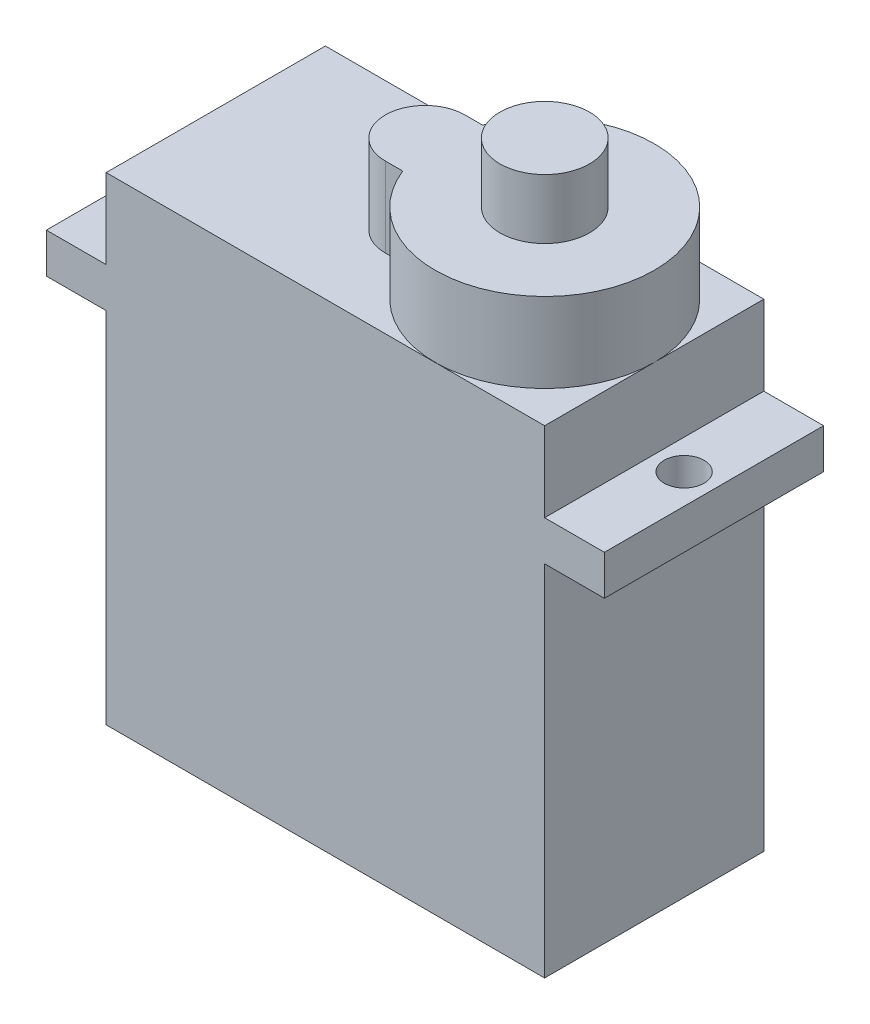
ISO-10303-21;
HEADER;
FILE_DESCRIPTION(('STEP AP214'),'2;1');
FILE_NAME('part.step','',(''),(''),'','','');
FILE_SCHEMA(('AUTOMOTIVE_DESIGN { 1 0 10303 214 1 1 1 1 }'));
ENDSEC;
DATA;
#1=APPLICATION_CONTEXT('core data for automotive mechanical design processes');
#2=APPLICATION_PROTOCOL_DEFINITION('international standard','automotive_design',2000,#1);
#3=PRODUCT_CONTEXT('',#1,'mechanical');
#4=PRODUCT('Part','Part','',(#3));
#5=PRODUCT_RELATED_PRODUCT_CATEGORY('part','',(#4));
#6=PRODUCT_DEFINITION_FORMATION('','',#4);
#7=PRODUCT_DEFINITION_CONTEXT('part definition',#1,'design');
#8=PRODUCT_DEFINITION('design','',#6,#7);
#9=PRODUCT_DEFINITION_SHAPE('','',#8);
#10=(LENGTH_UNIT() NAMED_UNIT(*) SI_UNIT(.MILLI.,.METRE.));
#11=(NAMED_UNIT(*) PLANE_ANGLE_UNIT() SI_UNIT($,.RADIAN.));
#12=(NAMED_UNIT(*) SI_UNIT($,.STERADIAN.) SOLID_ANGLE_UNIT());
#13=UNCERTAINTY_MEASURE_WITH_UNIT(LENGTH_MEASURE(1.E-05),#10,'distance_accuracy_value','');
#14=(GEOMETRIC_REPRESENTATION_CONTEXT(3) GLOBAL_UNCERTAINTY_ASSIGNED_CONTEXT((#13)) GLOBAL_UNIT_ASSIGNED_CONTEXT((#10,
#11,#12)) REPRESENTATION_CONTEXT('',''));
#15=CARTESIAN_POINT('',(0.,0.,0.));
#16=DIRECTION('',(0.,0.,1.));
#17=DIRECTION('',(1.,0.,0.));
#18=AXIS2_PLACEMENT_3D('',#15,#16,#17);
#19=CARTESIAN_POINT('',(11.,24.,5.5));
#20=DIRECTION('',(-1.,0.,0.));
#21=DIRECTION('',(0.,0.,1.));
#22=AXIS2_PLACEMENT_3D('',#19,#20,#21);
#23=PLANE('',#22);
#24=DIRECTION('',(0.,-1.,0.));
#25=VECTOR('',#24,1.);
#26=CARTESIAN_POINT('',(11.,24.,-5.5));
#27=LINE('',#26,#25);
#28=CARTESIAN_POINT('',(11.,18.,-5.5));
#29=VERTEX_POINT('',#28);
#30=CARTESIAN_POINT('',(11.,0.,-5.5));
#31=VERTEX_POINT('',#30);
#32=EDGE_CURVE('E64',#29,#31,#27,.T.);
#33=ORIENTED_EDGE('',*,*,#32,.F.);
#34=DIRECTION('',(0.,0.,1.));
#35=VECTOR('',#34,1.);
#36=CARTESIAN_POINT('',(11.,18.,-5.5));
#37=LINE('',#36,#35);
#38=CARTESIAN_POINT('',(11.,18.,5.5));
#39=VERTEX_POINT('',#38);
#40=EDGE_CURVE('E204',#29,#39,#37,.T.);
#41=ORIENTED_EDGE('',*,*,#40,.T.);
#42=DIRECTION('',(0.,-1.,0.));
#43=VECTOR('',#42,1.);
#44=CARTESIAN_POINT('',(11.,24.,5.5));
#45=LINE('',#44,#43);
#46=CARTESIAN_POINT('',(11.,0.,5.5));
#47=VERTEX_POINT('',#46);
#48=EDGE_CURVE('E180',#39,#47,#45,.T.);
#49=ORIENTED_EDGE('',*,*,#48,.T.);
#50=DIRECTION('',(0.,0.,-1.));
#51=VECTOR('',#50,1.);
#52=CARTESIAN_POINT('',(11.,0.,5.5));
#53=LINE('',#52,#51);
#54=EDGE_CURVE('E277',#47,#31,#53,.T.);
#55=ORIENTED_EDGE('',*,*,#54,.T.);
#56=EDGE_LOOP('',(#33,#41,#49,#55));
#57=FACE_BOUND('',#56,.T.);
#58=ADVANCED_FACE('F47',(#57),#23,.F.);
#59=CARTESIAN_POINT('',(-11.,24.,5.5));
#60=DIRECTION('',(1.,0.,0.));
#61=DIRECTION('',(0.,0.,-1.));
#62=AXIS2_PLACEMENT_3D('',#59,#60,#61);
#63=PLANE('',#62);
#64=DIRECTION('',(0.,0.,1.));
#65=VECTOR('',#64,1.);
#66=CARTESIAN_POINT('',(-11.,18.,-5.5));
#67=LINE('',#66,#65);
#68=CARTESIAN_POINT('',(-11.,18.,-5.5));
#69=VERTEX_POINT('',#68);
#70=CARTESIAN_POINT('',(-11.,18.,5.5));
#71=VERTEX_POINT('',#70);
#72=EDGE_CURVE('E219',#69,#71,#67,.T.);
#73=ORIENTED_EDGE('',*,*,#72,.F.);
#74=DIRECTION('',(0.,-1.,0.));
#75=VECTOR('',#74,1.);
#76=CARTESIAN_POINT('',(-11.,24.,-5.5));
#77=LINE('',#76,#75);
#78=CARTESIAN_POINT('',(-11.,0.,-5.5));
#79=VERTEX_POINT('',#78);
#80=EDGE_CURVE('E306',#69,#79,#77,.T.);
#81=ORIENTED_EDGE('',*,*,#80,.T.);
#82=DIRECTION('',(0.,0.,1.));
#83=VECTOR('',#82,1.);
#84=CARTESIAN_POINT('',(-11.,0.,5.5));
#85=LINE('',#84,#83);
#86=CARTESIAN_POINT('',(-11.,0.,5.5));
#87=VERTEX_POINT('',#86);
#88=EDGE_CURVE('E295',#79,#87,#85,.T.);
#89=ORIENTED_EDGE('',*,*,#88,.T.);
#90=DIRECTION('',(0.,-1.,0.));
#91=VECTOR('',#90,1.);
#92=CARTESIAN_POINT('',(-11.,24.,5.5));
#93=LINE('',#92,#91);
#94=EDGE_CURVE('E302',#71,#87,#93,.T.);
#95=ORIENTED_EDGE('',*,*,#94,.F.);
#96=EDGE_LOOP('',(#73,#81,#89,#95));
#97=FACE_BOUND('',#96,.T.);
#98=ADVANCED_FACE('F323',(#97),#63,.F.);
#99=DIRECTION('',(0.,0.,-1.));
#100=VECTOR('',#99,1.);
#101=CARTESIAN_POINT('',(-11.,20.,-5.5));
#102=LINE('',#101,#100);
#103=CARTESIAN_POINT('',(-11.,20.,5.5));
#104=VERTEX_POINT('',#103);
#105=CARTESIAN_POINT('',(-11.,20.,-5.5));
#106=VERTEX_POINT('',#105);
#107=EDGE_CURVE('E226',#104,#106,#102,.T.);
#108=ORIENTED_EDGE('',*,*,#107,.F.);
#109=CARTESIAN_POINT('',(-11.,24.,5.5));
#110=VERTEX_POINT('',#109);
#111=EDGE_CURVE('E303',#110,#104,#93,.T.);
#112=ORIENTED_EDGE('',*,*,#111,.F.);
#113=DIRECTION('',(0.,0.,1.));
#114=VECTOR('',#113,1.);
#115=CARTESIAN_POINT('',(-11.,24.,5.5));
#116=LINE('',#115,#114);
#117=CARTESIAN_POINT('',(-11.,24.,-5.5));
#118=VERTEX_POINT('',#117);
#119=EDGE_CURVE('E286',#118,#110,#116,.T.);
#120=ORIENTED_EDGE('',*,*,#119,.F.);
#121=EDGE_CURVE('E307',#118,#106,#77,.T.);
#122=ORIENTED_EDGE('',*,*,#121,.T.);
#123=EDGE_LOOP('',(#108,#112,#120,#122));
#124=FACE_BOUND('',#123,.T.);
#125=ADVANCED_FACE('F340',(#124),#63,.F.);
#126=CARTESIAN_POINT('',(0.,24.,0.));
#127=DIRECTION('',(0.,-1.,0.));
#128=DIRECTION('',(0.,0.,-1.));
#129=AXIS2_PLACEMENT_3D('',#126,#127,#128);
#130=PLANE('',#129);
#131=CARTESIAN_POINT('',(5.5,24.,-0.00650687555048789));
#132=DIRECTION('',(0.,1.,0.));
#133=DIRECTION('',(0.,0.,1.));
#134=AXIS2_PLACEMENT_3D('',#131,#132,#133);
#135=CIRCLE('',#134,5.5);
#136=CARTESIAN_POINT('',(11.,24.,-0.00650687555048789));
#137=VERTEX_POINT('',#136);
#138=CARTESIAN_POINT('',(5.76745708370865,24.,-5.5));
#139=VERTEX_POINT('',#138);
#140=EDGE_CURVE('E56',#137,#139,#135,.T.);
#141=ORIENTED_EDGE('',*,*,#140,.F.);
#142=DIRECTION('',(0.,0.,-1.));
#143=VECTOR('',#142,1.);
#144=CARTESIAN_POINT('',(11.,24.,5.5));
#145=LINE('',#144,#143);
#146=CARTESIAN_POINT('',(11.,24.,-5.5));
#147=VERTEX_POINT('',#146);
#148=EDGE_CURVE('E282',#137,#147,#145,.T.);
#149=ORIENTED_EDGE('',*,*,#148,.T.);
#150=DIRECTION('',(-1.,0.,0.));
#151=VECTOR('',#150,1.);
#152=CARTESIAN_POINT('',(-11.,24.,-5.5));
#153=LINE('',#152,#151);
#154=EDGE_CURVE('E283',#147,#139,#153,.T.);
#155=ORIENTED_EDGE('',*,*,#154,.T.);
#156=EDGE_LOOP('',(#141,#149,#155));
#157=FACE_BOUND('',#156,.T.);
#158=ADVANCED_FACE('F357',(#157),#130,.F.);
#159=CARTESIAN_POINT('',(0.376524617020198,24.,1.99349312444951));
#160=VERTEX_POINT('',#159);
#161=EDGE_CURVE('E254',#160,#137,#135,.T.);
#162=ORIENTED_EDGE('',*,*,#161,.F.);
#163=DIRECTION('',(1.,0.,0.));
#164=VECTOR('',#163,1.);
#165=CARTESIAN_POINT('',(-0.500000000000002,24.,1.99349312444951));
#166=LINE('',#165,#164);
#167=CARTESIAN_POINT('',(-0.500000000000002,24.,1.99349312444951));
#168=VERTEX_POINT('',#167);
#169=EDGE_CURVE('E247',#168,#160,#166,.T.);
#170=ORIENTED_EDGE('',*,*,#169,.F.);
#171=CARTESIAN_POINT('',(-0.500000000000002,24.,-0.00650687555048789));
#172=DIRECTION('',(0.,1.,0.));
#173=DIRECTION('',(0.,0.,1.));
#174=AXIS2_PLACEMENT_3D('',#171,#172,#173);
#175=CIRCLE('',#174,2.);
#176=CARTESIAN_POINT('',(-0.500000000000002,24.,-2.00650687555049));
#177=VERTEX_POINT('',#176);
#178=EDGE_CURVE('E261',#177,#168,#175,.T.);
#179=ORIENTED_EDGE('',*,*,#178,.F.);
#180=DIRECTION('',(-1.,0.,0.));
#181=VECTOR('',#180,1.);
#182=CARTESIAN_POINT('',(-0.500000000000002,24.,-2.00650687555049));
#183=LINE('',#182,#181);
#184=CARTESIAN_POINT('',(0.376524617020198,24.,-2.00650687555049));
#185=VERTEX_POINT('',#184);
#186=EDGE_CURVE('E257',#185,#177,#183,.T.);
#187=ORIENTED_EDGE('',*,*,#186,.F.);
#188=CARTESIAN_POINT('',(5.23254291629134,24.,-5.5));
#189=VERTEX_POINT('',#188);
#190=EDGE_CURVE('E258',#189,#185,#135,.T.);
#191=ORIENTED_EDGE('',*,*,#190,.F.);
#192=EDGE_CURVE('E281',#189,#118,#153,.T.);
#193=ORIENTED_EDGE('',*,*,#192,.T.);
#194=ORIENTED_EDGE('',*,*,#119,.T.);
#195=DIRECTION('',(1.,0.,0.));
#196=VECTOR('',#195,1.);
#197=CARTESIAN_POINT('',(-11.,24.,5.5));
#198=LINE('',#197,#196);
#199=CARTESIAN_POINT('',(11.,24.,5.5));
#200=VERTEX_POINT('',#199);
#201=EDGE_CURVE('E289',#110,#200,#198,.T.);
#202=ORIENTED_EDGE('',*,*,#201,.T.);
#203=EDGE_CURVE('E278',#200,#137,#145,.T.);
#204=ORIENTED_EDGE('',*,*,#203,.T.);
#205=EDGE_LOOP('',(#162,#170,#179,#187,#191,#193,#194,#202,#204));
#206=FACE_BOUND('',#205,.T.);
#207=ADVANCED_FACE('F345',(#206),#130,.F.);
#208=CARTESIAN_POINT('',(11.,20.,5.5));
#209=VERTEX_POINT('',#208);
#210=EDGE_CURVE('E300',#200,#209,#45,.T.);
#211=ORIENTED_EDGE('',*,*,#210,.T.);
#212=DIRECTION('',(0.,0.,-1.));
#213=VECTOR('',#212,1.);
#214=CARTESIAN_POINT('',(11.,20.,-5.5));
#215=LINE('',#214,#213);
#216=CARTESIAN_POINT('',(11.,20.,-5.5));
#217=VERTEX_POINT('',#216);
#218=EDGE_CURVE('E72',#209,#217,#215,.T.);
#219=ORIENTED_EDGE('',*,*,#218,.T.);
#220=EDGE_CURVE('E308',#147,#217,#27,.T.);
#221=ORIENTED_EDGE('',*,*,#220,.F.);
#222=ORIENTED_EDGE('',*,*,#148,.F.);
#223=ORIENTED_EDGE('',*,*,#203,.F.);
#224=EDGE_LOOP('',(#211,#219,#221,#222,#223));
#225=FACE_BOUND('',#224,.T.);
#226=ADVANCED_FACE('F49',(#225),#23,.F.);
#227=CARTESIAN_POINT('',(-11.,24.,-5.5));
#228=DIRECTION('',(0.,0.,1.));
#229=DIRECTION('',(1.,0.,0.));
#230=AXIS2_PLACEMENT_3D('',#227,#228,#229);
#231=PLANE('',#230);
#232=DIRECTION('',(-1.,0.,0.));
#233=VECTOR('',#232,1.);
#234=CARTESIAN_POINT('',(-11.,0.,-5.5));
#235=LINE('',#234,#233);
#236=EDGE_CURVE('E292',#31,#79,#235,.T.);
#237=ORIENTED_EDGE('',*,*,#236,.T.);
#238=ORIENTED_EDGE('',*,*,#80,.F.);
#239=DIRECTION('',(1.,0.,0.));
#240=VECTOR('',#239,1.);
#241=CARTESIAN_POINT('',(-14.,18.,-5.5));
#242=LINE('',#241,#240);
#243=CARTESIAN_POINT('',(-14.,18.,-5.5));
#244=VERTEX_POINT('',#243);
#245=EDGE_CURVE('E233',#244,#69,#242,.T.);
#246=ORIENTED_EDGE('',*,*,#245,.F.);
#247=DIRECTION('',(0.,-1.,0.));
#248=VECTOR('',#247,1.);
#249=CARTESIAN_POINT('',(-14.,20.,-5.5));
#250=LINE('',#249,#248);
#251=CARTESIAN_POINT('',(-14.,20.,-5.5));
#252=VERTEX_POINT('',#251);
#253=EDGE_CURVE('E221',#252,#244,#250,.T.);
#254=ORIENTED_EDGE('',*,*,#253,.F.);
#255=DIRECTION('',(1.,0.,0.));
#256=VECTOR('',#255,1.);
#257=CARTESIAN_POINT('',(-14.,20.,-5.5));
#258=LINE('',#257,#256);
#259=EDGE_CURVE('E236',#252,#106,#258,.T.);
#260=ORIENTED_EDGE('',*,*,#259,.T.);
#261=ORIENTED_EDGE('',*,*,#121,.F.);
#262=ORIENTED_EDGE('',*,*,#192,.F.);
#263=EDGE_CURVE('E287',#139,#189,#153,.T.);
#264=ORIENTED_EDGE('',*,*,#263,.F.);
#265=ORIENTED_EDGE('',*,*,#154,.F.);
#266=ORIENTED_EDGE('',*,*,#220,.T.);
#267=DIRECTION('',(-1.,0.,0.));
#268=VECTOR('',#267,1.);
#269=CARTESIAN_POINT('',(14.,20.,-5.5));
#270=LINE('',#269,#268);
#271=CARTESIAN_POINT('',(14.,20.,-5.5));
#272=VERTEX_POINT('',#271);
#273=EDGE_CURVE('E209',#272,#217,#270,.T.);
#274=ORIENTED_EDGE('',*,*,#273,.F.);
#275=DIRECTION('',(0.,-1.,0.));
#276=VECTOR('',#275,1.);
#277=CARTESIAN_POINT('',(14.,20.,-5.5));
#278=LINE('',#277,#276);
#279=CARTESIAN_POINT('',(14.,18.,-5.5));
#280=VERTEX_POINT('',#279);
#281=EDGE_CURVE('E197',#272,#280,#278,.T.);
#282=ORIENTED_EDGE('',*,*,#281,.T.);
#283=DIRECTION('',(-1.,0.,0.));
#284=VECTOR('',#283,1.);
#285=CARTESIAN_POINT('',(14.,18.,-5.5));
#286=LINE('',#285,#284);
#287=EDGE_CURVE('E185',#280,#29,#286,.T.);
#288=ORIENTED_EDGE('',*,*,#287,.T.);
#289=ORIENTED_EDGE('',*,*,#32,.T.);
#290=EDGE_LOOP('',(#237,#238,#246,#254,#260,#261,#262,#264,#265,#266,#274,#282,#288,#289));
#291=FACE_BOUND('',#290,.T.);
#292=ADVANCED_FACE('F313',(#291),#231,.F.);
#293=CARTESIAN_POINT('',(-11.,24.,5.5));
#294=DIRECTION('',(0.,0.,-1.));
#295=DIRECTION('',(-1.,0.,0.));
#296=AXIS2_PLACEMENT_3D('',#293,#294,#295);
#297=PLANE('',#296);
#298=DIRECTION('',(1.,0.,0.));
#299=VECTOR('',#298,1.);
#300=CARTESIAN_POINT('',(-11.,0.,5.5));
#301=LINE('',#300,#299);
#302=EDGE_CURVE('E298',#87,#47,#301,.T.);
#303=ORIENTED_EDGE('',*,*,#302,.T.);
#304=ORIENTED_EDGE('',*,*,#48,.F.);
#305=DIRECTION('',(-1.,0.,0.));
#306=VECTOR('',#305,1.);
#307=CARTESIAN_POINT('',(14.,18.,5.5));
#308=LINE('',#307,#306);
#309=CARTESIAN_POINT('',(14.,18.,5.5));
#310=VERTEX_POINT('',#309);
#311=EDGE_CURVE('E173',#310,#39,#308,.T.);
#312=ORIENTED_EDGE('',*,*,#311,.F.);
#313=DIRECTION('',(0.,1.,0.));
#314=VECTOR('',#313,1.);
#315=CARTESIAN_POINT('',(14.,20.,5.5));
#316=LINE('',#315,#314);
#317=CARTESIAN_POINT('',(14.,20.,5.5));
#318=VERTEX_POINT('',#317);
#319=EDGE_CURVE('E178',#310,#318,#316,.T.);
#320=ORIENTED_EDGE('',*,*,#319,.T.);
#321=DIRECTION('',(-1.,0.,0.));
#322=VECTOR('',#321,1.);
#323=CARTESIAN_POINT('',(14.,20.,5.5));
#324=LINE('',#323,#322);
#325=EDGE_CURVE('E203',#318,#209,#324,.T.);
#326=ORIENTED_EDGE('',*,*,#325,.T.);
#327=ORIENTED_EDGE('',*,*,#210,.F.);
#328=ORIENTED_EDGE('',*,*,#201,.F.);
#329=ORIENTED_EDGE('',*,*,#111,.T.);
#330=DIRECTION('',(1.,0.,0.));
#331=VECTOR('',#330,1.);
#332=CARTESIAN_POINT('',(-14.,20.,5.5));
#333=LINE('',#332,#331);
#334=CARTESIAN_POINT('',(-14.,20.,5.5));
#335=VERTEX_POINT('',#334);
#336=EDGE_CURVE('E239',#335,#104,#333,.T.);
#337=ORIENTED_EDGE('',*,*,#336,.F.);
#338=DIRECTION('',(0.,1.,0.));
#339=VECTOR('',#338,1.);
#340=CARTESIAN_POINT('',(-14.,20.,5.5));
#341=LINE('',#340,#339);
#342=CARTESIAN_POINT('',(-14.,18.,5.5));
#343=VERTEX_POINT('',#342);
#344=EDGE_CURVE('E215',#343,#335,#341,.T.);
#345=ORIENTED_EDGE('',*,*,#344,.F.);
#346=DIRECTION('',(1.,0.,0.));
#347=VECTOR('',#346,1.);
#348=CARTESIAN_POINT('',(-14.,18.,5.5));
#349=LINE('',#348,#347);
#350=EDGE_CURVE('E225',#343,#71,#349,.T.);
#351=ORIENTED_EDGE('',*,*,#350,.T.);
#352=ORIENTED_EDGE('',*,*,#94,.T.);
#353=EDGE_LOOP('',(#303,#304,#312,#320,#326,#327,#328,#329,#337,#345,#351,#352));
#354=FACE_BOUND('',#353,.T.);
#355=ADVANCED_FACE('F176',(#354),#297,.F.);
#356=CARTESIAN_POINT('',(0.,0.,0.));
#357=DIRECTION('',(0.,-1.,0.));
#358=DIRECTION('',(0.,0.,-1.));
#359=AXIS2_PLACEMENT_3D('',#356,#357,#358);
#360=PLANE('',#359);
#361=ORIENTED_EDGE('',*,*,#54,.F.);
#362=ORIENTED_EDGE('',*,*,#302,.F.);
#363=ORIENTED_EDGE('',*,*,#88,.F.);
#364=ORIENTED_EDGE('',*,*,#236,.F.);
#365=EDGE_LOOP('',(#361,#362,#363,#364));
#366=FACE_BOUND('',#365,.T.);
#367=ADVANCED_FACE('F318',(#366),#360,.T.);
#368=CARTESIAN_POINT('',(5.5,24.,-0.00650687555048789));
#369=DIRECTION('',(0.,1.,0.));
#370=DIRECTION('',(0.,0.,1.));
#371=AXIS2_PLACEMENT_3D('',#368,#369,#370);
#372=PLANE('',#371);
#373=EDGE_CURVE('E242',#139,#189,#135,.T.);
#374=ORIENTED_EDGE('',*,*,#373,.F.);
#375=ORIENTED_EDGE('',*,*,#263,.T.);
#376=EDGE_LOOP('',(#374,#375));
#377=FACE_BOUND('',#376,.T.);
#378=ADVANCED_FACE('F350',(#377),#372,.F.);
#379=CARTESIAN_POINT('',(5.5,28.,-0.00650687555048789));
#380=DIRECTION('',(0.,-1.,0.));
#381=DIRECTION('',(0.,0.,-1.));
#382=AXIS2_PLACEMENT_3D('',#379,#380,#381);
#383=CYLINDRICAL_SURFACE('',#382,5.5);
#384=ORIENTED_EDGE('',*,*,#161,.T.);
#385=ORIENTED_EDGE('',*,*,#140,.T.);
#386=ORIENTED_EDGE('',*,*,#373,.T.);
#387=ORIENTED_EDGE('',*,*,#190,.T.);
#388=DIRECTION('',(0.,-1.,0.));
#389=VECTOR('',#388,1.);
#390=CARTESIAN_POINT('',(0.376524617020198,28.,-2.00650687555049));
#391=LINE('',#390,#389);
#392=CARTESIAN_POINT('',(0.376524617020198,28.,-2.00650687555049));
#393=VERTEX_POINT('',#392);
#394=EDGE_CURVE('E274',#393,#185,#391,.T.);
#395=ORIENTED_EDGE('',*,*,#394,.F.);
#396=CARTESIAN_POINT('',(5.5,28.,-0.00650687555048789));
#397=DIRECTION('',(0.,1.,0.));
#398=DIRECTION('',(0.,0.,1.));
#399=AXIS2_PLACEMENT_3D('',#396,#397,#398);
#400=CIRCLE('',#399,5.5);
#401=CARTESIAN_POINT('',(0.376524617020198,28.,1.99349312444951));
#402=VERTEX_POINT('',#401);
#403=EDGE_CURVE('E243',#402,#393,#400,.T.);
#404=ORIENTED_EDGE('',*,*,#403,.F.);
#405=DIRECTION('',(0.,-1.,0.));
#406=VECTOR('',#405,1.);
#407=CARTESIAN_POINT('',(0.376524617020198,28.,1.99349312444951));
#408=LINE('',#407,#406);
#409=EDGE_CURVE('E253',#402,#160,#408,.T.);
#410=ORIENTED_EDGE('',*,*,#409,.T.);
#411=EDGE_LOOP('',(#384,#385,#386,#387,#395,#404,#410));
#412=FACE_BOUND('',#411,.T.);
#413=ADVANCED_FACE('F353',(#412),#383,.T.);
#414=CARTESIAN_POINT('',(-0.500000000000002,28.,-2.00650687555049));
#415=DIRECTION('',(0.,0.,1.));
#416=DIRECTION('',(1.,0.,0.));
#417=AXIS2_PLACEMENT_3D('',#414,#415,#416);
#418=PLANE('',#417);
#419=ORIENTED_EDGE('',*,*,#186,.T.);
#420=DIRECTION('',(0.,-1.,0.));
#421=VECTOR('',#420,1.);
#422=CARTESIAN_POINT('',(-0.500000000000002,28.,-2.00650687555049));
#423=LINE('',#422,#421);
#424=CARTESIAN_POINT('',(-0.500000000000002,28.,-2.00650687555049));
#425=VERTEX_POINT('',#424);
#426=EDGE_CURVE('E271',#425,#177,#423,.T.);
#427=ORIENTED_EDGE('',*,*,#426,.F.);
#428=DIRECTION('',(-1.,0.,0.));
#429=VECTOR('',#428,1.);
#430=CARTESIAN_POINT('',(-0.500000000000002,28.,-2.00650687555049));
#431=LINE('',#430,#429);
#432=EDGE_CURVE('E246',#393,#425,#431,.T.);
#433=ORIENTED_EDGE('',*,*,#432,.F.);
#434=ORIENTED_EDGE('',*,*,#394,.T.);
#435=EDGE_LOOP('',(#419,#427,#433,#434));
#436=FACE_BOUND('',#435,.T.);
#437=ADVANCED_FACE('F415',(#436),#418,.F.);
#438=CARTESIAN_POINT('',(-0.500000000000002,28.,-0.00650687555048789));
#439=DIRECTION('',(0.,-1.,0.));
#440=DIRECTION('',(0.,0.,-1.));
#441=AXIS2_PLACEMENT_3D('',#438,#439,#440);
#442=CYLINDRICAL_SURFACE('',#441,2.);
#443=ORIENTED_EDGE('',*,*,#178,.T.);
#444=DIRECTION('',(0.,-1.,0.));
#445=VECTOR('',#444,1.);
#446=CARTESIAN_POINT('',(-0.500000000000002,28.,1.99349312444951));
#447=LINE('',#446,#445);
#448=CARTESIAN_POINT('',(-0.500000000000002,28.,1.99349312444951));
#449=VERTEX_POINT('',#448);
#450=EDGE_CURVE('E268',#449,#168,#447,.T.);
#451=ORIENTED_EDGE('',*,*,#450,.F.);
#452=CARTESIAN_POINT('',(-0.500000000000002,28.,-0.00650687555048789));
#453=DIRECTION('',(0.,1.,0.));
#454=DIRECTION('',(0.,0.,1.));
#455=AXIS2_PLACEMENT_3D('',#452,#453,#454);
#456=CIRCLE('',#455,2.);
#457=EDGE_CURVE('E249',#425,#449,#456,.T.);
#458=ORIENTED_EDGE('',*,*,#457,.F.);
#459=ORIENTED_EDGE('',*,*,#426,.T.);
#460=EDGE_LOOP('',(#443,#451,#458,#459));
#461=FACE_BOUND('',#460,.T.);
#462=ADVANCED_FACE('F421',(#461),#442,.T.);
#463=CARTESIAN_POINT('',(-0.500000000000002,28.,1.99349312444951));
#464=DIRECTION('',(0.,0.,-1.));
#465=DIRECTION('',(-1.,0.,0.));
#466=AXIS2_PLACEMENT_3D('',#463,#464,#465);
#467=PLANE('',#466);
#468=ORIENTED_EDGE('',*,*,#169,.T.);
#469=ORIENTED_EDGE('',*,*,#409,.F.);
#470=DIRECTION('',(1.,0.,0.));
#471=VECTOR('',#470,1.);
#472=CARTESIAN_POINT('',(-0.500000000000002,28.,1.99349312444951));
#473=LINE('',#472,#471);
#474=EDGE_CURVE('E251',#449,#402,#473,.T.);
#475=ORIENTED_EDGE('',*,*,#474,.F.);
#476=ORIENTED_EDGE('',*,*,#450,.T.);
#477=EDGE_LOOP('',(#468,#469,#475,#476));
#478=FACE_BOUND('',#477,.T.);
#479=ADVANCED_FACE('F428',(#478),#467,.F.);
#480=CARTESIAN_POINT('',(5.5,28.,-0.00650687555048789));
#481=DIRECTION('',(0.,1.,0.));
#482=DIRECTION('',(0.,0.,1.));
#483=AXIS2_PLACEMENT_3D('',#480,#481,#482);
#484=PLANE('',#483);
#485=CARTESIAN_POINT('',(5.5,28.,-0.00650687555048789));
#486=DIRECTION('',(0.,1.,0.));
#487=DIRECTION('',(0.,0.,1.));
#488=AXIS2_PLACEMENT_3D('',#485,#486,#487);
#489=CIRCLE('',#488,2.25);
#490=CARTESIAN_POINT('',(5.5,28.,2.24349312444951));
#491=VERTEX_POINT('',#490);
#492=EDGE_CURVE('E13',#491,#491,#489,.T.);
#493=ORIENTED_EDGE('',*,*,#492,.F.);
#494=EDGE_LOOP('',(#493));
#495=FACE_BOUND('',#494,.T.);
#496=ORIENTED_EDGE('',*,*,#403,.T.);
#497=ORIENTED_EDGE('',*,*,#432,.T.);
#498=ORIENTED_EDGE('',*,*,#457,.T.);
#499=ORIENTED_EDGE('',*,*,#474,.T.);
#500=EDGE_LOOP('',(#496,#497,#498,#499));
#501=FACE_BOUND('',#500,.T.);
#502=ADVANCED_FACE('F436',(#495,#501),#484,.T.);
#503=CARTESIAN_POINT('',(-14.,20.,-5.5));
#504=DIRECTION('',(0.,-1.,0.));
#505=DIRECTION('',(0.,0.,-1.));
#506=AXIS2_PLACEMENT_3D('',#503,#504,#505);
#507=PLANE('',#506);
#508=CARTESIAN_POINT('',(-12.5,20.,0.));
#509=DIRECTION('',(0.,1.,0.));
#510=DIRECTION('',(0.,0.,1.));
#511=AXIS2_PLACEMENT_3D('',#508,#509,#510);
#512=CIRCLE('',#511,1.);
#513=CARTESIAN_POINT('',(-12.5,20.,1.));
#514=VERTEX_POINT('',#513);
#515=EDGE_CURVE('E184',#514,#514,#512,.T.);
#516=ORIENTED_EDGE('',*,*,#515,.F.);
#517=EDGE_LOOP('',(#516));
#518=FACE_BOUND('',#517,.T.);
#519=ORIENTED_EDGE('',*,*,#107,.T.);
#520=ORIENTED_EDGE('',*,*,#259,.F.);
#521=DIRECTION('',(0.,0.,-1.));
#522=VECTOR('',#521,1.);
#523=CARTESIAN_POINT('',(-14.,20.,-5.5));
#524=LINE('',#523,#522);
#525=EDGE_CURVE('E218',#335,#252,#524,.T.);
#526=ORIENTED_EDGE('',*,*,#525,.F.);
#527=ORIENTED_EDGE('',*,*,#336,.T.);
#528=EDGE_LOOP('',(#519,#520,#526,#527));
#529=FACE_BOUND('',#528,.T.);
#530=ADVANCED_FACE('F337',(#518,#529),#507,.F.);
#531=CARTESIAN_POINT('',(-14.,18.,-5.5));
#532=DIRECTION('',(0.,1.,0.));
#533=DIRECTION('',(0.,0.,1.));
#534=AXIS2_PLACEMENT_3D('',#531,#532,#533);
#535=PLANE('',#534);
#536=CARTESIAN_POINT('',(-12.5,18.,0.));
#537=DIRECTION('',(0.,1.,0.));
#538=DIRECTION('',(0.,0.,1.));
#539=AXIS2_PLACEMENT_3D('',#536,#537,#538);
#540=CIRCLE('',#539,1.);
#541=CARTESIAN_POINT('',(-12.5,18.,1.));
#542=VERTEX_POINT('',#541);
#543=EDGE_CURVE('E51',#542,#542,#540,.T.);
#544=ORIENTED_EDGE('',*,*,#543,.T.);
#545=EDGE_LOOP('',(#544));
#546=FACE_BOUND('',#545,.T.);
#547=ORIENTED_EDGE('',*,*,#72,.T.);
#548=ORIENTED_EDGE('',*,*,#350,.F.);
#549=DIRECTION('',(0.,0.,1.));
#550=VECTOR('',#549,1.);
#551=CARTESIAN_POINT('',(-14.,18.,-5.5));
#552=LINE('',#551,#550);
#553=EDGE_CURVE('E223',#244,#343,#552,.T.);
#554=ORIENTED_EDGE('',*,*,#553,.F.);
#555=ORIENTED_EDGE('',*,*,#245,.T.);
#556=EDGE_LOOP('',(#547,#548,#554,#555));
#557=FACE_BOUND('',#556,.T.);
#558=ADVANCED_FACE('F328',(#546,#557),#535,.F.);
#559=CARTESIAN_POINT('',(-14.,0.,0.));
#560=DIRECTION('',(-1.,0.,0.));
#561=DIRECTION('',(0.,0.,1.));
#562=AXIS2_PLACEMENT_3D('',#559,#560,#561);
#563=PLANE('',#562);
#564=ORIENTED_EDGE('',*,*,#344,.T.);
#565=ORIENTED_EDGE('',*,*,#525,.T.);
#566=ORIENTED_EDGE('',*,*,#253,.T.);
#567=ORIENTED_EDGE('',*,*,#553,.T.);
#568=EDGE_LOOP('',(#564,#565,#566,#567));
#569=FACE_BOUND('',#568,.T.);
#570=ADVANCED_FACE('F330',(#569),#563,.T.);
#571=CARTESIAN_POINT('',(-12.5,0.,0.));
#572=DIRECTION('',(0.,1.,0.));
#573=DIRECTION('',(0.,0.,1.));
#574=AXIS2_PLACEMENT_3D('',#571,#572,#573);
#575=CYLINDRICAL_SURFACE('',#574,1.);
#576=ORIENTED_EDGE('',*,*,#515,.T.);
#577=EDGE_LOOP('',(#576));
#578=FACE_BOUND('',#577,.T.);
#579=ORIENTED_EDGE('',*,*,#543,.F.);
#580=EDGE_LOOP('',(#579));
#581=FACE_BOUND('',#580,.T.);
#582=ADVANCED_FACE('F369',(#578,#581),#575,.F.);
#583=CARTESIAN_POINT('',(14.,18.,-5.5));
#584=DIRECTION('',(0.,-1.,0.));
#585=DIRECTION('',(0.,0.,-1.));
#586=AXIS2_PLACEMENT_3D('',#583,#584,#585);
#587=PLANE('',#586);
#588=CARTESIAN_POINT('',(12.5,18.,0.));
#589=DIRECTION('',(0.,-1.,0.));
#590=DIRECTION('',(0.,0.,-1.));
#591=AXIS2_PLACEMENT_3D('',#588,#589,#590);
#592=CIRCLE('',#591,1.);
#593=CARTESIAN_POINT('',(12.5,18.,-1.));
#594=VERTEX_POINT('',#593);
#595=EDGE_CURVE('E206',#594,#594,#592,.F.);
#596=ORIENTED_EDGE('',*,*,#595,.T.);
#597=EDGE_LOOP('',(#596));
#598=FACE_BOUND('',#597,.T.);
#599=ORIENTED_EDGE('',*,*,#40,.F.);
#600=ORIENTED_EDGE('',*,*,#287,.F.);
#601=DIRECTION('',(0.,0.,1.));
#602=VECTOR('',#601,1.);
#603=CARTESIAN_POINT('',(14.,18.,-5.5));
#604=LINE('',#603,#602);
#605=EDGE_CURVE('E191',#280,#310,#604,.T.);
#606=ORIENTED_EDGE('',*,*,#605,.T.);
#607=ORIENTED_EDGE('',*,*,#311,.T.);
#608=EDGE_LOOP('',(#599,#600,#606,#607));
#609=FACE_BOUND('',#608,.T.);
#610=ADVANCED_FACE('F196',(#598,#609),#587,.T.);
#611=CARTESIAN_POINT('',(14.,20.,-5.5));
#612=DIRECTION('',(0.,1.,0.));
#613=DIRECTION('',(0.,0.,1.));
#614=AXIS2_PLACEMENT_3D('',#611,#612,#613);
#615=PLANE('',#614);
#616=CARTESIAN_POINT('',(12.5,20.,0.));
#617=DIRECTION('',(0.,-1.,0.));
#618=DIRECTION('',(0.,0.,1.));
#619=AXIS2_PLACEMENT_3D('',#616,#617,#618);
#620=CIRCLE('',#619,1.);
#621=CARTESIAN_POINT('',(12.5,20.,1.));
#622=VERTEX_POINT('',#621);
#623=EDGE_CURVE('E601',#622,#622,#620,.T.);
#624=ORIENTED_EDGE('',*,*,#623,.T.);
#625=EDGE_LOOP('',(#624));
#626=FACE_BOUND('',#625,.T.);
#627=ORIENTED_EDGE('',*,*,#218,.F.);
#628=ORIENTED_EDGE('',*,*,#325,.F.);
#629=DIRECTION('',(0.,0.,-1.));
#630=VECTOR('',#629,1.);
#631=CARTESIAN_POINT('',(14.,20.,-5.5));
#632=LINE('',#631,#630);
#633=EDGE_CURVE('E194',#318,#272,#632,.T.);
#634=ORIENTED_EDGE('',*,*,#633,.T.);
#635=ORIENTED_EDGE('',*,*,#273,.T.);
#636=EDGE_LOOP('',(#627,#628,#634,#635));
#637=FACE_BOUND('',#636,.T.);
#638=ADVANCED_FACE('F359',(#626,#637),#615,.T.);
#639=CARTESIAN_POINT('',(14.,0.,0.));
#640=DIRECTION('',(1.,0.,0.));
#641=DIRECTION('',(0.,0.,1.));
#642=AXIS2_PLACEMENT_3D('',#639,#640,#641);
#643=PLANE('',#642);
#644=ORIENTED_EDGE('',*,*,#319,.F.);
#645=ORIENTED_EDGE('',*,*,#605,.F.);
#646=ORIENTED_EDGE('',*,*,#281,.F.);
#647=ORIENTED_EDGE('',*,*,#633,.F.);
#648=EDGE_LOOP('',(#644,#645,#646,#647));
#649=FACE_BOUND('',#648,.T.);
#650=ADVANCED_FACE('F189',(#649),#643,.T.);
#651=CARTESIAN_POINT('',(12.5,0.,0.));
#652=DIRECTION('',(0.,1.,0.));
#653=DIRECTION('',(0.,0.,1.));
#654=AXIS2_PLACEMENT_3D('',#651,#652,#653);
#655=CYLINDRICAL_SURFACE('',#654,1.);
#656=ORIENTED_EDGE('',*,*,#595,.F.);
#657=EDGE_LOOP('',(#656));
#658=FACE_BOUND('',#657,.T.);
#659=ORIENTED_EDGE('',*,*,#623,.F.);
#660=EDGE_LOOP('',(#659));
#661=FACE_BOUND('',#660,.T.);
#662=ADVANCED_FACE('F367',(#658,#661),#655,.F.);
#663=CARTESIAN_POINT('',(5.5,31.,-0.00650687555048789));
#664=DIRECTION('',(0.,-1.,0.));
#665=DIRECTION('',(0.,0.,-1.));
#666=AXIS2_PLACEMENT_3D('',#663,#664,#665);
#667=CYLINDRICAL_SURFACE('',#666,2.25);
#668=CARTESIAN_POINT('',(5.5,31.,-0.00650687555048789));
#669=DIRECTION('',(0.,1.,0.));
#670=DIRECTION('',(0.,0.,1.));
#671=AXIS2_PLACEMENT_3D('',#668,#669,#670);
#672=CIRCLE('',#671,2.25);
#673=CARTESIAN_POINT('',(5.5,31.,2.24349312444951));
#674=VERTEX_POINT('',#673);
#675=EDGE_CURVE('E600',#674,#674,#672,.T.);
#676=ORIENTED_EDGE('',*,*,#675,.F.);
#677=EDGE_LOOP('',(#676));
#678=FACE_BOUND('',#677,.T.);
#679=ORIENTED_EDGE('',*,*,#492,.T.);
#680=EDGE_LOOP('',(#679));
#681=FACE_BOUND('',#680,.T.);
#682=ADVANCED_FACE('F493',(#678,#681),#667,.T.);
#683=CARTESIAN_POINT('',(5.5,31.,-0.00650687555048789));
#684=DIRECTION('',(0.,1.,0.));
#685=DIRECTION('',(0.,0.,1.));
#686=AXIS2_PLACEMENT_3D('',#683,#684,#685);
#687=PLANE('',#686);
#688=ORIENTED_EDGE('',*,*,#675,.T.);
#689=EDGE_LOOP('',(#688));
#690=FACE_BOUND('',#689,.T.);
#691=ADVANCED_FACE('F500',(#690),#687,.T.);
#692=CLOSED_SHELL('',(#58,#98,#125,#158,#207,#226,#292,#355,#367,#378,#413,#437,#462,#479,#502,
#530,#558,#570,#582,#610,#638,#650,#662,#682,#691));
#693=MANIFOLD_SOLID_BREP('B2',#692);
#694=ADVANCED_BREP_SHAPE_REPRESENTATION('',(#18,#693),#14);
#695=SHAPE_DEFINITION_REPRESENTATION(#9,#694);
ENDSEC;
END-ISO-10303-21;
